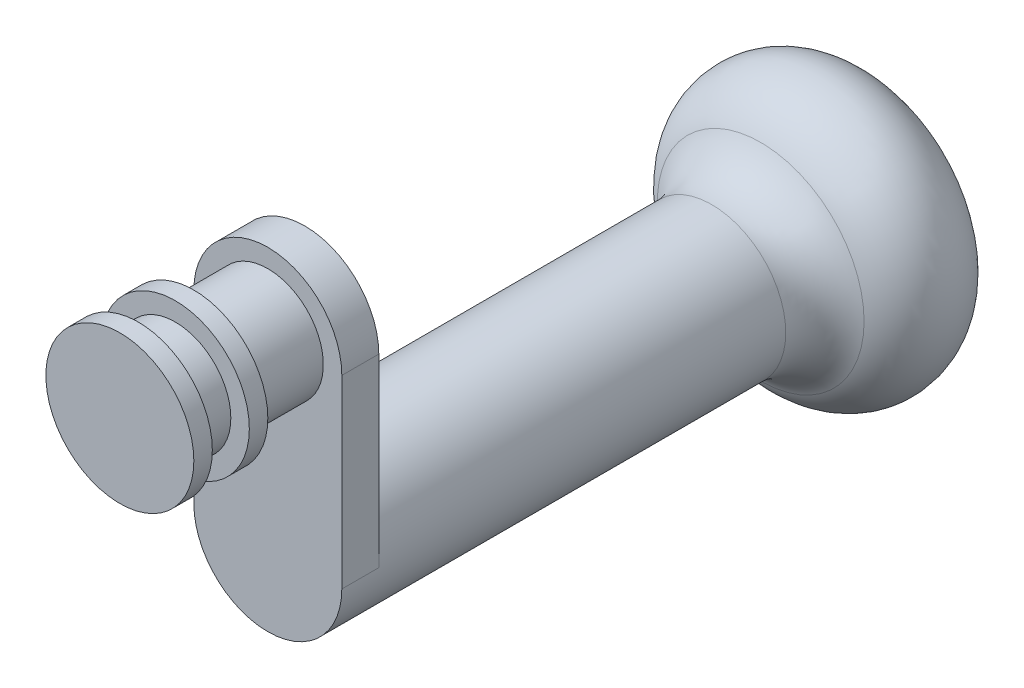
ISO-10303-21;
HEADER;
FILE_DESCRIPTION(('STEP AP214'),'2;1');
FILE_NAME('part.step','',(''),(''),'','','');
FILE_SCHEMA(('AUTOMOTIVE_DESIGN { 1 0 10303 214 1 1 1 1 }'));
ENDSEC;
DATA;
#1=APPLICATION_CONTEXT('core data for automotive mechanical design processes');
#2=APPLICATION_PROTOCOL_DEFINITION('international standard','automotive_design',2000,#1);
#3=PRODUCT_CONTEXT('',#1,'mechanical');
#4=PRODUCT('Part','Part','',(#3));
#5=PRODUCT_RELATED_PRODUCT_CATEGORY('part','',(#4));
#6=PRODUCT_DEFINITION_FORMATION('','',#4);
#7=PRODUCT_DEFINITION_CONTEXT('part definition',#1,'design');
#8=PRODUCT_DEFINITION('design','',#6,#7);
#9=PRODUCT_DEFINITION_SHAPE('','',#8);
#10=(LENGTH_UNIT() NAMED_UNIT(*) SI_UNIT(.MILLI.,.METRE.));
#11=(NAMED_UNIT(*) PLANE_ANGLE_UNIT() SI_UNIT($,.RADIAN.));
#12=(NAMED_UNIT(*) SI_UNIT($,.STERADIAN.) SOLID_ANGLE_UNIT());
#13=UNCERTAINTY_MEASURE_WITH_UNIT(LENGTH_MEASURE(1.E-05),#10,'distance_accuracy_value','');
#14=(GEOMETRIC_REPRESENTATION_CONTEXT(3) GLOBAL_UNCERTAINTY_ASSIGNED_CONTEXT((#13)) GLOBAL_UNIT_ASSIGNED_CONTEXT((#10,
#11,#12)) REPRESENTATION_CONTEXT('',''));
#15=CARTESIAN_POINT('',(0.,0.,0.));
#16=DIRECTION('',(0.,0.,1.));
#17=DIRECTION('',(1.,0.,0.));
#18=AXIS2_PLACEMENT_3D('',#15,#16,#17);
#19=CARTESIAN_POINT('',(0.,0.,25.));
#20=DIRECTION('',(0.,0.,-1.));
#21=DIRECTION('',(-1.,0.,0.));
#22=AXIS2_PLACEMENT_3D('',#19,#20,#21);
#23=CYLINDRICAL_SURFACE('',#22,7.5);
#24=CARTESIAN_POINT('',(0.,0.,15.));
#25=DIRECTION('',(0.,0.,1.));
#26=DIRECTION('',(1.,0.,0.));
#27=AXIS2_PLACEMENT_3D('',#24,#25,#26);
#28=CIRCLE('',#27,7.5);
#29=CARTESIAN_POINT('',(7.5,0.,15.));
#30=VERTEX_POINT('',#29);
#31=EDGE_CURVE('E144',#30,#30,#28,.T.);
#32=ORIENTED_EDGE('',*,*,#31,.F.);
#33=EDGE_LOOP('',(#32));
#34=FACE_BOUND('',#33,.T.);
#35=CARTESIAN_POINT('',(0.,0.,5.));
#36=DIRECTION('',(0.,0.,-1.));
#37=DIRECTION('',(-1.,0.,0.));
#38=AXIS2_PLACEMENT_3D('',#35,#36,#37);
#39=CIRCLE('',#38,7.5);
#40=CARTESIAN_POINT('',(-7.5,0.,5.));
#41=VERTEX_POINT('',#40);
#42=EDGE_CURVE('E51',#41,#41,#39,.T.);
#43=ORIENTED_EDGE('',*,*,#42,.F.);
#44=EDGE_LOOP('',(#43));
#45=FACE_BOUND('',#44,.T.);
#46=ADVANCED_FACE('F41',(#34,#45),#23,.T.);
#47=CARTESIAN_POINT('',(0.,0.,17.5));
#48=DIRECTION('',(0.,0.,1.));
#49=DIRECTION('',(1.,0.,0.));
#50=AXIS2_PLACEMENT_3D('',#47,#48,#49);
#51=CIRCLE('',#50,7.5);
#52=CARTESIAN_POINT('',(7.5,0.,17.5));
#53=VERTEX_POINT('',#52);
#54=EDGE_CURVE('E128',#53,#53,#51,.T.);
#55=ORIENTED_EDGE('',*,*,#54,.T.);
#56=EDGE_LOOP('',(#55));
#57=FACE_BOUND('',#56,.T.);
#58=CARTESIAN_POINT('',(0.,0.,22.5));
#59=DIRECTION('',(0.,0.,1.));
#60=DIRECTION('',(1.,0.,0.));
#61=AXIS2_PLACEMENT_3D('',#58,#59,#60);
#62=CIRCLE('',#61,7.5);
#63=CARTESIAN_POINT('',(7.5,0.,22.5));
#64=VERTEX_POINT('',#63);
#65=EDGE_CURVE('E136',#64,#64,#62,.T.);
#66=ORIENTED_EDGE('',*,*,#65,.F.);
#67=EDGE_LOOP('',(#66));
#68=FACE_BOUND('',#67,.T.);
#69=ADVANCED_FACE('F43',(#57,#68),#23,.T.);
#70=CARTESIAN_POINT('',(0.,0.,22.5));
#71=DIRECTION('',(0.,0.,1.));
#72=DIRECTION('',(1.,0.,0.));
#73=AXIS2_PLACEMENT_3D('',#70,#71,#72);
#74=CYLINDRICAL_SURFACE('',#73,10.);
#75=CARTESIAN_POINT('',(0.,0.,22.5));
#76=DIRECTION('',(0.,0.,1.));
#77=DIRECTION('',(1.,0.,0.));
#78=AXIS2_PLACEMENT_3D('',#75,#76,#77);
#79=CIRCLE('',#78,10.);
#80=CARTESIAN_POINT('',(10.,0.,22.5));
#81=VERTEX_POINT('',#80);
#82=EDGE_CURVE('E132',#81,#81,#79,.T.);
#83=ORIENTED_EDGE('',*,*,#82,.T.);
#84=EDGE_LOOP('',(#83));
#85=FACE_BOUND('',#84,.T.);
#86=CARTESIAN_POINT('',(0.,0.,25.));
#87=DIRECTION('',(0.,0.,1.));
#88=DIRECTION('',(1.,0.,0.));
#89=AXIS2_PLACEMENT_3D('',#86,#87,#88);
#90=CIRCLE('',#89,10.);
#91=CARTESIAN_POINT('',(10.,0.,25.));
#92=VERTEX_POINT('',#91);
#93=EDGE_CURVE('E137',#92,#92,#90,.T.);
#94=ORIENTED_EDGE('',*,*,#93,.F.);
#95=EDGE_LOOP('',(#94));
#96=FACE_BOUND('',#95,.T.);
#97=ADVANCED_FACE('F162',(#85,#96),#74,.T.);
#98=CARTESIAN_POINT('',(0.,0.,22.5));
#99=DIRECTION('',(0.,0.,1.));
#100=DIRECTION('',(1.,0.,0.));
#101=AXIS2_PLACEMENT_3D('',#98,#99,#100);
#102=PLANE('',#101);
#103=ORIENTED_EDGE('',*,*,#65,.T.);
#104=EDGE_LOOP('',(#103));
#105=FACE_BOUND('',#104,.T.);
#106=ORIENTED_EDGE('',*,*,#82,.F.);
#107=EDGE_LOOP('',(#106));
#108=FACE_BOUND('',#107,.T.);
#109=ADVANCED_FACE('F190',(#105,#108),#102,.F.);
#110=CARTESIAN_POINT('',(0.,0.,25.));
#111=DIRECTION('',(0.,0.,1.));
#112=DIRECTION('',(1.,0.,0.));
#113=AXIS2_PLACEMENT_3D('',#110,#111,#112);
#114=PLANE('',#113);
#115=ORIENTED_EDGE('',*,*,#93,.T.);
#116=EDGE_LOOP('',(#115));
#117=FACE_BOUND('',#116,.T.);
#118=ADVANCED_FACE('F176',(#117),#114,.T.);
#119=CARTESIAN_POINT('',(0.,0.,15.));
#120=DIRECTION('',(0.,0.,1.));
#121=DIRECTION('',(1.,0.,0.));
#122=AXIS2_PLACEMENT_3D('',#119,#120,#121);
#123=CYLINDRICAL_SURFACE('',#122,10.);
#124=CARTESIAN_POINT('',(0.,0.,15.));
#125=DIRECTION('',(0.,0.,1.));
#126=DIRECTION('',(1.,0.,0.));
#127=AXIS2_PLACEMENT_3D('',#124,#125,#126);
#128=CIRCLE('',#127,10.);
#129=CARTESIAN_POINT('',(10.,0.,15.));
#130=VERTEX_POINT('',#129);
#131=EDGE_CURVE('E124',#130,#130,#128,.T.);
#132=ORIENTED_EDGE('',*,*,#131,.T.);
#133=EDGE_LOOP('',(#132));
#134=FACE_BOUND('',#133,.T.);
#135=CARTESIAN_POINT('',(0.,0.,17.5));
#136=DIRECTION('',(0.,0.,1.));
#137=DIRECTION('',(1.,0.,0.));
#138=AXIS2_PLACEMENT_3D('',#135,#136,#137);
#139=CIRCLE('',#138,10.);
#140=CARTESIAN_POINT('',(10.,0.,17.5));
#141=VERTEX_POINT('',#140);
#142=EDGE_CURVE('E117',#141,#141,#139,.T.);
#143=ORIENTED_EDGE('',*,*,#142,.F.);
#144=EDGE_LOOP('',(#143));
#145=FACE_BOUND('',#144,.T.);
#146=ADVANCED_FACE('F170',(#134,#145),#123,.T.);
#147=CARTESIAN_POINT('',(0.,0.,15.));
#148=DIRECTION('',(0.,0.,1.));
#149=DIRECTION('',(1.,0.,0.));
#150=AXIS2_PLACEMENT_3D('',#147,#148,#149);
#151=PLANE('',#150);
#152=ORIENTED_EDGE('',*,*,#31,.T.);
#153=EDGE_LOOP('',(#152));
#154=FACE_BOUND('',#153,.T.);
#155=ORIENTED_EDGE('',*,*,#131,.F.);
#156=EDGE_LOOP('',(#155));
#157=FACE_BOUND('',#156,.T.);
#158=ADVANCED_FACE('F166',(#154,#157),#151,.F.);
#159=CARTESIAN_POINT('',(0.,0.,17.5));
#160=DIRECTION('',(0.,0.,1.));
#161=DIRECTION('',(1.,0.,0.));
#162=AXIS2_PLACEMENT_3D('',#159,#160,#161);
#163=PLANE('',#162);
#164=ORIENTED_EDGE('',*,*,#54,.F.);
#165=EDGE_LOOP('',(#164));
#166=FACE_BOUND('',#165,.T.);
#167=ORIENTED_EDGE('',*,*,#142,.T.);
#168=EDGE_LOOP('',(#167));
#169=FACE_BOUND('',#168,.T.);
#170=ADVANCED_FACE('F169',(#166,#169),#163,.T.);
#171=CARTESIAN_POINT('',(0.,0.,5.));
#172=DIRECTION('',(0.,0.,-1.));
#173=DIRECTION('',(-1.,0.,0.));
#174=AXIS2_PLACEMENT_3D('',#171,#172,#173);
#175=CYLINDRICAL_SURFACE('',#174,10.);
#176=CARTESIAN_POINT('',(0.,0.,0.));
#177=DIRECTION('',(0.,0.,-1.));
#178=DIRECTION('',(-1.,0.,0.));
#179=AXIS2_PLACEMENT_3D('',#176,#177,#178);
#180=CIRCLE('',#179,10.);
#181=CARTESIAN_POINT('',(-10.,0.,0.));
#182=VERTEX_POINT('',#181);
#183=CARTESIAN_POINT('',(10.,0.,0.));
#184=VERTEX_POINT('',#183);
#185=EDGE_CURVE('E108',#182,#184,#180,.T.);
#186=ORIENTED_EDGE('',*,*,#185,.F.);
#187=DIRECTION('',(0.,0.,-1.));
#188=VECTOR('',#187,1.);
#189=CARTESIAN_POINT('',(-10.,0.,5.));
#190=LINE('',#189,#188);
#191=CARTESIAN_POINT('',(-10.,0.,5.));
#192=VERTEX_POINT('',#191);
#193=EDGE_CURVE('E59',#192,#182,#190,.T.);
#194=ORIENTED_EDGE('',*,*,#193,.F.);
#195=CARTESIAN_POINT('',(0.,0.,5.));
#196=DIRECTION('',(0.,0.,-1.));
#197=DIRECTION('',(-1.,0.,0.));
#198=AXIS2_PLACEMENT_3D('',#195,#196,#197);
#199=CIRCLE('',#198,10.);
#200=CARTESIAN_POINT('',(10.,0.,5.));
#201=VERTEX_POINT('',#200);
#202=EDGE_CURVE('E95',#192,#201,#199,.T.);
#203=ORIENTED_EDGE('',*,*,#202,.T.);
#204=DIRECTION('',(0.,0.,-1.));
#205=VECTOR('',#204,1.);
#206=CARTESIAN_POINT('',(10.,0.,5.));
#207=LINE('',#206,#205);
#208=EDGE_CURVE('E83',#201,#184,#207,.T.);
#209=ORIENTED_EDGE('',*,*,#208,.T.);
#210=EDGE_LOOP('',(#186,#194,#203,#209));
#211=FACE_BOUND('',#210,.T.);
#212=ADVANCED_FACE('F181',(#211),#175,.T.);
#213=CARTESIAN_POINT('',(-10.,0.,5.));
#214=DIRECTION('',(-1.,0.,0.));
#215=DIRECTION('',(0.,-1.,0.));
#216=AXIS2_PLACEMENT_3D('',#213,#214,#215);
#217=PLANE('',#216);
#218=DIRECTION('',(0.,1.,0.));
#219=VECTOR('',#218,1.);
#220=CARTESIAN_POINT('',(-10.,0.,0.));
#221=LINE('',#220,#219);
#222=CARTESIAN_POINT('',(-10.,-25.,0.));
#223=VERTEX_POINT('',#222);
#224=EDGE_CURVE('E87',#223,#182,#221,.T.);
#225=ORIENTED_EDGE('',*,*,#224,.F.);
#226=DIRECTION('',(0.,0.,-1.));
#227=VECTOR('',#226,1.);
#228=CARTESIAN_POINT('',(-10.,-25.,5.));
#229=LINE('',#228,#227);
#230=CARTESIAN_POINT('',(-10.,-25.,5.));
#231=VERTEX_POINT('',#230);
#232=EDGE_CURVE('E90',#231,#223,#229,.T.);
#233=ORIENTED_EDGE('',*,*,#232,.F.);
#234=DIRECTION('',(0.,1.,0.));
#235=VECTOR('',#234,1.);
#236=CARTESIAN_POINT('',(-10.,0.,5.));
#237=LINE('',#236,#235);
#238=EDGE_CURVE('E123',#231,#192,#237,.T.);
#239=ORIENTED_EDGE('',*,*,#238,.T.);
#240=ORIENTED_EDGE('',*,*,#193,.T.);
#241=EDGE_LOOP('',(#225,#233,#239,#240));
#242=FACE_BOUND('',#241,.T.);
#243=ADVANCED_FACE('F89',(#242),#217,.T.);
#244=CARTESIAN_POINT('',(0.,-25.,5.));
#245=DIRECTION('',(0.,0.,-1.));
#246=DIRECTION('',(-1.,0.,0.));
#247=AXIS2_PLACEMENT_3D('',#244,#245,#246);
#248=CYLINDRICAL_SURFACE('',#247,10.);
#249=ORIENTED_EDGE('',*,*,#232,.T.);
#250=CARTESIAN_POINT('',(0.,-25.,0.));
#251=DIRECTION('',(0.,0.,1.));
#252=DIRECTION('',(1.,0.,0.));
#253=AXIS2_PLACEMENT_3D('',#250,#251,#252);
#254=CIRCLE('',#253,10.);
#255=CARTESIAN_POINT('',(10.,-25.,0.));
#256=VERTEX_POINT('',#255);
#257=EDGE_CURVE('E11',#256,#223,#254,.T.);
#258=ORIENTED_EDGE('',*,*,#257,.F.);
#259=DIRECTION('',(0.,0.,-1.));
#260=VECTOR('',#259,1.);
#261=CARTESIAN_POINT('',(10.,-25.,5.));
#262=LINE('',#261,#260);
#263=CARTESIAN_POINT('',(10.,-25.,5.));
#264=VERTEX_POINT('',#263);
#265=EDGE_CURVE('E75',#264,#256,#262,.T.);
#266=ORIENTED_EDGE('',*,*,#265,.F.);
#267=CARTESIAN_POINT('',(0.,-25.,5.));
#268=DIRECTION('',(0.,0.,-1.));
#269=DIRECTION('',(-1.,0.,0.));
#270=AXIS2_PLACEMENT_3D('',#267,#268,#269);
#271=CIRCLE('',#270,10.);
#272=EDGE_CURVE('E103',#264,#231,#271,.T.);
#273=ORIENTED_EDGE('',*,*,#272,.T.);
#274=EDGE_LOOP('',(#249,#258,#266,#273));
#275=FACE_BOUND('',#274,.T.);
#276=CARTESIAN_POINT('',(0.,-25.,-55.));
#277=DIRECTION('',(0.,0.,1.));
#278=DIRECTION('',(1.,0.,0.));
#279=AXIS2_PLACEMENT_3D('',#276,#277,#278);
#280=CIRCLE('',#279,10.);
#281=CARTESIAN_POINT('',(10.,-25.,-55.));
#282=VERTEX_POINT('',#281);
#283=EDGE_CURVE('E112',#282,#282,#280,.T.);
#284=ORIENTED_EDGE('',*,*,#283,.T.);
#285=EDGE_LOOP('',(#284));
#286=FACE_BOUND('',#285,.T.);
#287=ADVANCED_FACE('F100',(#275,#286),#248,.T.);
#288=CARTESIAN_POINT('',(10.,0.,5.));
#289=DIRECTION('',(1.,0.,0.));
#290=DIRECTION('',(0.,1.,0.));
#291=AXIS2_PLACEMENT_3D('',#288,#289,#290);
#292=PLANE('',#291);
#293=DIRECTION('',(0.,-1.,0.));
#294=VECTOR('',#293,1.);
#295=CARTESIAN_POINT('',(10.,0.,0.));
#296=LINE('',#295,#294);
#297=EDGE_CURVE('E96',#184,#256,#296,.T.);
#298=ORIENTED_EDGE('',*,*,#297,.F.);
#299=ORIENTED_EDGE('',*,*,#208,.F.);
#300=DIRECTION('',(0.,-1.,0.));
#301=VECTOR('',#300,1.);
#302=CARTESIAN_POINT('',(10.,0.,5.));
#303=LINE('',#302,#301);
#304=EDGE_CURVE('E295',#201,#264,#303,.T.);
#305=ORIENTED_EDGE('',*,*,#304,.T.);
#306=ORIENTED_EDGE('',*,*,#265,.T.);
#307=EDGE_LOOP('',(#298,#299,#305,#306));
#308=FACE_BOUND('',#307,.T.);
#309=ADVANCED_FACE('F208',(#308),#292,.T.);
#310=CARTESIAN_POINT('',(0.,0.,5.));
#311=DIRECTION('',(0.,0.,-1.));
#312=DIRECTION('',(-1.,0.,0.));
#313=AXIS2_PLACEMENT_3D('',#310,#311,#312);
#314=PLANE('',#313);
#315=ORIENTED_EDGE('',*,*,#42,.T.);
#316=EDGE_LOOP('',(#315));
#317=FACE_BOUND('',#316,.T.);
#318=ORIENTED_EDGE('',*,*,#238,.F.);
#319=ORIENTED_EDGE('',*,*,#272,.F.);
#320=ORIENTED_EDGE('',*,*,#304,.F.);
#321=ORIENTED_EDGE('',*,*,#202,.F.);
#322=EDGE_LOOP('',(#318,#319,#320,#321));
#323=FACE_BOUND('',#322,.T.);
#324=ADVANCED_FACE('F154',(#317,#323),#314,.F.);
#325=CARTESIAN_POINT('',(0.,0.,0.));
#326=DIRECTION('',(0.,0.,1.));
#327=DIRECTION('',(1.,0.,0.));
#328=AXIS2_PLACEMENT_3D('',#325,#326,#327);
#329=PLANE('',#328);
#330=ORIENTED_EDGE('',*,*,#297,.T.);
#331=ORIENTED_EDGE('',*,*,#257,.T.);
#332=ORIENTED_EDGE('',*,*,#224,.T.);
#333=ORIENTED_EDGE('',*,*,#185,.T.);
#334=EDGE_LOOP('',(#330,#331,#332,#333));
#335=FACE_BOUND('',#334,.T.);
#336=ADVANCED_FACE('F107',(#335),#329,.F.);
#337=CARTESIAN_POINT('',(0.,-25.,-55.));
#338=DIRECTION('',(0.,0.,1.));
#339=DIRECTION('',(1.,0.,0.));
#340=AXIS2_PLACEMENT_3D('',#337,#338,#339);
#341=TOROIDAL_SURFACE('',#340,17.5,7.5);
#342=ORIENTED_EDGE('',*,*,#283,.F.);
#343=EDGE_LOOP('',(#342));
#344=FACE_BOUND('',#343,.T.);
#345=CARTESIAN_POINT('',(0.,-25.,-61.6176470588235));
#346=DIRECTION('',(0.,0.,1.));
#347=DIRECTION('',(1.,0.,0.));
#348=AXIS2_PLACEMENT_3D('',#345,#346,#347);
#349=CIRCLE('',#348,13.9705882352941);
#350=CARTESIAN_POINT('',(13.9705882352941,-25.,-61.6176470588235));
#351=VERTEX_POINT('',#350);
#352=EDGE_CURVE('E284',#351,#351,#349,.T.);
#353=ORIENTED_EDGE('',*,*,#352,.T.);
#354=EDGE_LOOP('',(#353));
#355=FACE_BOUND('',#354,.T.);
#356=ADVANCED_FACE('F200',(#344,#355),#341,.F.);
#357=CARTESIAN_POINT('',(0.,-25.,-69.0625));
#358=DIRECTION('',(0.,0.,1.));
#359=DIRECTION('',(1.,0.,0.));
#360=AXIS2_PLACEMENT_3D('',#357,#358,#359);
#361=TOROIDAL_SURFACE('',#360,10.,8.43750000000001);
#362=ORIENTED_EDGE('',*,*,#352,.F.);
#363=EDGE_LOOP('',(#362));
#364=FACE_BOUND('',#363,.T.);
#365=CARTESIAN_POINT('',(0.,-25.,-77.5));
#366=DIRECTION('',(0.,0.,1.));
#367=DIRECTION('',(1.,0.,0.));
#368=AXIS2_PLACEMENT_3D('',#365,#366,#367);
#369=CIRCLE('',#368,10.);
#370=CARTESIAN_POINT('',(10.,-25.,-77.5));
#371=VERTEX_POINT('',#370);
#372=EDGE_CURVE('E281',#371,#371,#369,.T.);
#373=ORIENTED_EDGE('',*,*,#372,.T.);
#374=EDGE_LOOP('',(#373));
#375=FACE_BOUND('',#374,.T.);
#376=ADVANCED_FACE('F205',(#364,#375),#361,.T.);
#377=CARTESIAN_POINT('',(0.,-15.,-77.5));
#378=DIRECTION('',(0.,0.,1.));
#379=DIRECTION('',(1.,0.,0.));
#380=AXIS2_PLACEMENT_3D('',#377,#378,#379);
#381=PLANE('',#380);
#382=ORIENTED_EDGE('',*,*,#372,.F.);
#383=EDGE_LOOP('',(#382));
#384=FACE_BOUND('',#383,.T.);
#385=ADVANCED_FACE('F266',(#384),#381,.F.);
#386=CLOSED_SHELL('',(#46,#69,#97,#109,#118,#146,#158,#170,#212,#243,#287,#309,#324,#336,#356,
#376,#385));
#387=MANIFOLD_SOLID_BREP('B2',#386);
#388=ADVANCED_BREP_SHAPE_REPRESENTATION('',(#18,#387),#14);
#389=SHAPE_DEFINITION_REPRESENTATION(#9,#388);
ENDSEC;
END-ISO-10303-21;
